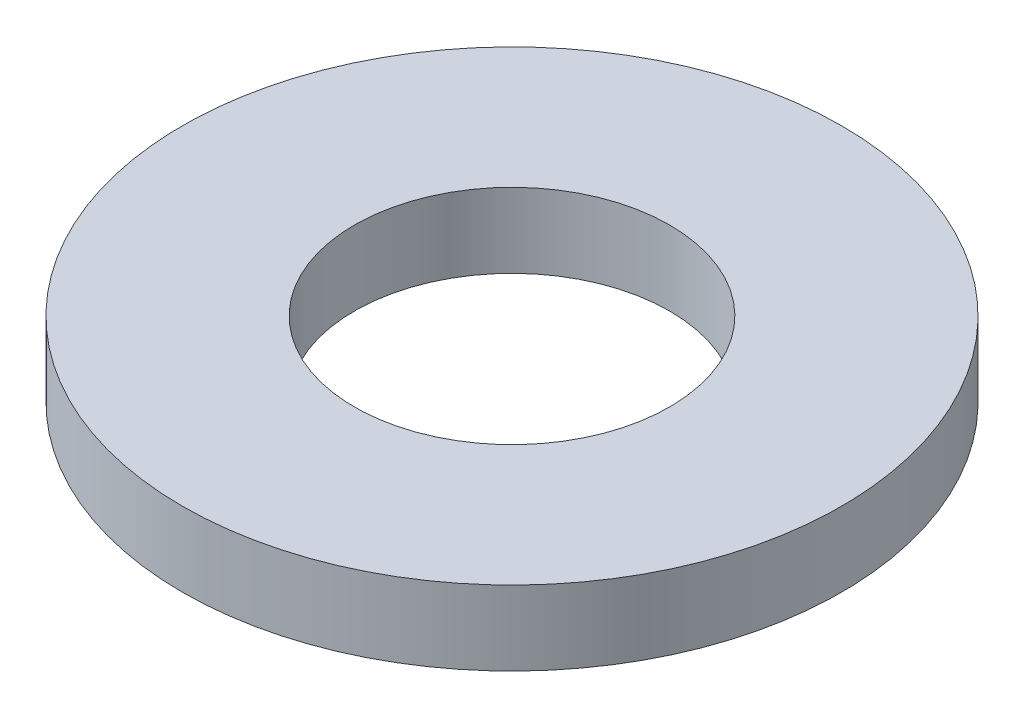
ISO-10303-21;
HEADER;
FILE_DESCRIPTION(('STEP AP214'),'2;1');
FILE_NAME('part.step','',(''),(''),'','','');
FILE_SCHEMA(('AUTOMOTIVE_DESIGN { 1 0 10303 214 1 1 1 1 }'));
ENDSEC;
DATA;
#1=APPLICATION_CONTEXT('core data for automotive mechanical design processes');
#2=APPLICATION_PROTOCOL_DEFINITION('international standard','automotive_design',2000,#1);
#3=PRODUCT_CONTEXT('',#1,'mechanical');
#4=PRODUCT('Part','Part','',(#3));
#5=PRODUCT_RELATED_PRODUCT_CATEGORY('part','',(#4));
#6=PRODUCT_DEFINITION_FORMATION('','',#4);
#7=PRODUCT_DEFINITION_CONTEXT('part definition',#1,'design');
#8=PRODUCT_DEFINITION('design','',#6,#7);
#9=PRODUCT_DEFINITION_SHAPE('','',#8);
#10=(LENGTH_UNIT() NAMED_UNIT(*) SI_UNIT(.MILLI.,.METRE.));
#11=(NAMED_UNIT(*) PLANE_ANGLE_UNIT() SI_UNIT($,.RADIAN.));
#12=(NAMED_UNIT(*) SI_UNIT($,.STERADIAN.) SOLID_ANGLE_UNIT());
#13=UNCERTAINTY_MEASURE_WITH_UNIT(LENGTH_MEASURE(1.E-05),#10,'distance_accuracy_value','');
#14=(GEOMETRIC_REPRESENTATION_CONTEXT(3) GLOBAL_UNCERTAINTY_ASSIGNED_CONTEXT((#13)) GLOBAL_UNIT_ASSIGNED_CONTEXT((#10,
#11,#12)) REPRESENTATION_CONTEXT('',''));
#15=CARTESIAN_POINT('',(0.,0.,0.));
#16=DIRECTION('',(0.,0.,1.));
#17=DIRECTION('',(1.,0.,0.));
#18=AXIS2_PLACEMENT_3D('',#15,#16,#17);
#19=CARTESIAN_POINT('',(0.,13.,0.));
#20=DIRECTION('',(0.,-1.,0.));
#21=DIRECTION('',(0.,0.,-1.));
#22=AXIS2_PLACEMENT_3D('',#19,#20,#21);
#23=CYLINDRICAL_SURFACE('',#22,57.5);
#24=CARTESIAN_POINT('',(0.,13.,0.));
#25=DIRECTION('',(0.,1.,0.));
#26=DIRECTION('',(0.,0.,1.));
#27=AXIS2_PLACEMENT_3D('',#24,#25,#26);
#28=CIRCLE('',#27,57.5);
#29=CARTESIAN_POINT('',(0.,13.,-57.5));
#30=VERTEX_POINT('',#29);
#31=EDGE_CURVE('E10',#30,#30,#28,.T.);
#32=CARTESIAN_POINT('',(0.,0.,0.));
#33=DIRECTION('',(0.,1.,0.));
#34=DIRECTION('',(0.,0.,1.));
#35=AXIS2_PLACEMENT_3D('',#32,#33,#34);
#36=CIRCLE('',#35,57.5);
#37=CARTESIAN_POINT('',(0.,0.,-57.5));
#38=VERTEX_POINT('',#37);
#39=EDGE_CURVE('E37',#38,#38,#36,.T.);
#40=CARTESIAN_POINT('',(0.,13.,-57.5));
#41=CARTESIAN_POINT('',(0.,12.8645833333333,-57.5));
#42=CARTESIAN_POINT('',(0.,12.7291666666667,-57.5));
#43=CARTESIAN_POINT('',(0.,12.4583333333333,-57.5));
#44=CARTESIAN_POINT('',(0.,12.3229166666667,-57.5));
#45=CARTESIAN_POINT('',(0.,12.0520833333333,-57.5));
#46=CARTESIAN_POINT('',(0.,11.9166666666667,-57.5));
#47=CARTESIAN_POINT('',(0.,11.6458333333333,-57.5));
#48=CARTESIAN_POINT('',(0.,11.5104166666667,-57.5));
#49=CARTESIAN_POINT('',(0.,11.2395833333333,-57.5));
#50=CARTESIAN_POINT('',(0.,11.1041666666667,-57.5));
#51=CARTESIAN_POINT('',(0.,10.8333333333333,-57.5));
#52=CARTESIAN_POINT('',(0.,10.6979166666667,-57.5));
#53=CARTESIAN_POINT('',(0.,10.4270833333333,-57.5));
#54=CARTESIAN_POINT('',(0.,10.2916666666667,-57.5));
#55=CARTESIAN_POINT('',(0.,10.0208333333333,-57.5));
#56=CARTESIAN_POINT('',(0.,9.88541666666667,-57.5));
#57=CARTESIAN_POINT('',(0.,9.61458333333333,-57.5));
#58=CARTESIAN_POINT('',(0.,9.47916666666667,-57.5));
#59=CARTESIAN_POINT('',(0.,9.20833333333333,-57.5));
#60=CARTESIAN_POINT('',(0.,9.07291666666667,-57.5));
#61=CARTESIAN_POINT('',(0.,8.80208333333333,-57.5));
#62=CARTESIAN_POINT('',(0.,8.66666666666667,-57.5));
#63=CARTESIAN_POINT('',(0.,8.39583333333333,-57.5));
#64=CARTESIAN_POINT('',(0.,8.26041666666667,-57.5));
#65=CARTESIAN_POINT('',(0.,7.98958333333333,-57.5));
#66=CARTESIAN_POINT('',(0.,7.85416666666667,-57.5));
#67=CARTESIAN_POINT('',(0.,7.58333333333333,-57.5));
#68=CARTESIAN_POINT('',(0.,7.44791666666667,-57.5));
#69=CARTESIAN_POINT('',(0.,7.17708333333333,-57.5));
#70=CARTESIAN_POINT('',(0.,7.04166666666667,-57.5));
#71=CARTESIAN_POINT('',(0.,6.77083333333333,-57.5));
#72=CARTESIAN_POINT('',(0.,6.63541666666667,-57.5));
#73=CARTESIAN_POINT('',(0.,6.36458333333333,-57.5));
#74=CARTESIAN_POINT('',(0.,6.22916666666667,-57.5));
#75=CARTESIAN_POINT('',(0.,5.95833333333333,-57.5));
#76=CARTESIAN_POINT('',(0.,5.82291666666667,-57.5));
#77=CARTESIAN_POINT('',(0.,5.55208333333333,-57.5));
#78=CARTESIAN_POINT('',(0.,5.41666666666667,-57.5));
#79=CARTESIAN_POINT('',(0.,5.14583333333333,-57.5));
#80=CARTESIAN_POINT('',(0.,5.01041666666667,-57.5));
#81=CARTESIAN_POINT('',(0.,4.73958333333333,-57.5));
#82=CARTESIAN_POINT('',(0.,4.60416666666667,-57.5));
#83=CARTESIAN_POINT('',(0.,4.33333333333333,-57.5));
#84=CARTESIAN_POINT('',(0.,4.19791666666667,-57.5));
#85=CARTESIAN_POINT('',(0.,3.92708333333333,-57.5));
#86=CARTESIAN_POINT('',(0.,3.79166666666667,-57.5));
#87=CARTESIAN_POINT('',(0.,3.52083333333333,-57.5));
#88=CARTESIAN_POINT('',(0.,3.38541666666667,-57.5));
#89=CARTESIAN_POINT('',(0.,3.11458333333333,-57.5));
#90=CARTESIAN_POINT('',(0.,2.97916666666667,-57.5));
#91=CARTESIAN_POINT('',(0.,2.70833333333333,-57.5));
#92=CARTESIAN_POINT('',(0.,2.57291666666667,-57.5));
#93=CARTESIAN_POINT('',(0.,2.30208333333333,-57.5));
#94=CARTESIAN_POINT('',(0.,2.16666666666667,-57.5));
#95=CARTESIAN_POINT('',(0.,1.89583333333333,-57.5));
#96=CARTESIAN_POINT('',(0.,1.76041666666667,-57.5));
#97=CARTESIAN_POINT('',(0.,1.48958333333333,-57.5));
#98=CARTESIAN_POINT('',(0.,1.35416666666667,-57.5));
#99=CARTESIAN_POINT('',(0.,1.08333333333333,-57.5));
#100=CARTESIAN_POINT('',(0.,0.947916666666667,-57.5));
#101=CARTESIAN_POINT('',(0.,0.677083333333334,-57.5));
#102=CARTESIAN_POINT('',(0.,0.541666666666667,-57.5));
#103=CARTESIAN_POINT('',(0.,0.270833333333334,-57.5));
#104=CARTESIAN_POINT('',(0.,0.135416666666667,-57.5));
#105=CARTESIAN_POINT('',(0.,0.,-57.5));
#106=B_SPLINE_CURVE_WITH_KNOTS('',3,(#40,#41,#42,#43,#44,#45,#46,#47,#48,#49,#50,#51,#52,#53,
#54,#55,#56,#57,#58,#59,#60,#61,#62,#63,#64,#65,#66,#67,#68,#69,#70,#71,#72,#73,#74,#75,#76,#77,
#78,#79,#80,#81,#82,#83,#84,#85,#86,#87,#88,#89,#90,#91,#92,#93,#94,#95,#96,#97,#98,#99,#100,
#101,#102,#103,#104,#105),.UNSPECIFIED.,.F.,.F.,(4,2,2,2,2,2,2,2,2,2,2,2,2,2,2,2,2,2,2,2,2,2,2,
2,2,2,2,2,2,2,2,2,4),(0.,0.406249999999999,0.812499999999999,1.21875,1.625,2.03125,2.4375,
2.84375,3.25,3.65625,4.0625,4.46875,4.875,5.28125,5.6875,6.09375,6.5,6.90625,7.3125,7.71875,
8.125,8.53125,8.9375,9.34375,9.75,10.15625,10.5625,10.96875,11.375,11.78125,12.1875,12.59375,
13.),.UNSPECIFIED.);
#107=EDGE_CURVE('BSEAM40',#30,#38,#106,.T.);
#108=ORIENTED_EDGE('',*,*,#31,.F.);
#109=ORIENTED_EDGE('',*,*,#39,.T.);
#110=ORIENTED_EDGE('',*,*,#107,.T.);
#111=ORIENTED_EDGE('',*,*,#107,.F.);
#112=EDGE_LOOP('',(#108,#110,#109,#111));
#113=FACE_BOUND('',#112,.T.);
#114=ADVANCED_FACE('F40',(#113),#23,.T.);
#115=CARTESIAN_POINT('',(0.,13.,0.));
#116=DIRECTION('',(0.,1.,0.));
#117=DIRECTION('',(0.,0.,1.));
#118=AXIS2_PLACEMENT_3D('',#115,#116,#117);
#119=PLANE('',#118);
#120=CARTESIAN_POINT('',(0.,13.,0.));
#121=DIRECTION('',(0.,1.,0.));
#122=DIRECTION('',(0.,0.,1.));
#123=AXIS2_PLACEMENT_3D('',#120,#121,#122);
#124=CIRCLE('',#123,27.5);
#125=CARTESIAN_POINT('',(0.,13.,-27.5));
#126=VERTEX_POINT('',#125);
#127=EDGE_CURVE('E50',#126,#126,#124,.T.);
#128=ORIENTED_EDGE('',*,*,#127,.F.);
#129=EDGE_LOOP('',(#128));
#130=FACE_BOUND('',#129,.T.);
#131=ORIENTED_EDGE('',*,*,#31,.T.);
#132=EDGE_LOOP('',(#131));
#133=FACE_BOUND('',#132,.T.);
#134=ADVANCED_FACE('F59',(#130,#133),#119,.T.);
#135=CARTESIAN_POINT('',(0.,0.,0.));
#136=DIRECTION('',(0.,1.,0.));
#137=DIRECTION('',(0.,0.,1.));
#138=AXIS2_PLACEMENT_3D('',#135,#136,#137);
#139=PLANE('',#138);
#140=CARTESIAN_POINT('',(0.,0.,0.));
#141=DIRECTION('',(0.,1.,0.));
#142=DIRECTION('',(0.,0.,1.));
#143=AXIS2_PLACEMENT_3D('',#140,#141,#142);
#144=CIRCLE('',#143,27.5);
#145=CARTESIAN_POINT('',(0.,0.,-27.5));
#146=VERTEX_POINT('',#145);
#147=EDGE_CURVE('E47',#146,#146,#144,.T.);
#148=ORIENTED_EDGE('',*,*,#147,.T.);
#149=EDGE_LOOP('',(#148));
#150=FACE_BOUND('',#149,.T.);
#151=ORIENTED_EDGE('',*,*,#39,.F.);
#152=EDGE_LOOP('',(#151));
#153=FACE_BOUND('',#152,.T.);
#154=ADVANCED_FACE('F58',(#150,#153),#139,.F.);
#155=CARTESIAN_POINT('',(0.,13.,0.));
#156=DIRECTION('',(0.,-1.,0.));
#157=DIRECTION('',(0.,0.,-1.));
#158=AXIS2_PLACEMENT_3D('',#155,#156,#157);
#159=CYLINDRICAL_SURFACE('',#158,27.5);
#160=CARTESIAN_POINT('',(0.,13.,-27.5));
#161=CARTESIAN_POINT('',(0.,12.8645833333333,-27.5));
#162=CARTESIAN_POINT('',(0.,12.7291666666667,-27.5));
#163=CARTESIAN_POINT('',(0.,12.4583333333333,-27.5));
#164=CARTESIAN_POINT('',(0.,12.3229166666667,-27.5));
#165=CARTESIAN_POINT('',(0.,12.0520833333333,-27.5));
#166=CARTESIAN_POINT('',(0.,11.9166666666667,-27.5));
#167=CARTESIAN_POINT('',(0.,11.6458333333333,-27.5));
#168=CARTESIAN_POINT('',(0.,11.5104166666667,-27.5));
#169=CARTESIAN_POINT('',(0.,11.2395833333333,-27.5));
#170=CARTESIAN_POINT('',(0.,11.1041666666667,-27.5));
#171=CARTESIAN_POINT('',(0.,10.8333333333333,-27.5));
#172=CARTESIAN_POINT('',(0.,10.6979166666667,-27.5));
#173=CARTESIAN_POINT('',(0.,10.4270833333333,-27.5));
#174=CARTESIAN_POINT('',(0.,10.2916666666667,-27.5));
#175=CARTESIAN_POINT('',(0.,10.0208333333333,-27.5));
#176=CARTESIAN_POINT('',(0.,9.88541666666667,-27.5));
#177=CARTESIAN_POINT('',(0.,9.61458333333333,-27.5));
#178=CARTESIAN_POINT('',(0.,9.47916666666667,-27.5));
#179=CARTESIAN_POINT('',(0.,9.20833333333333,-27.5));
#180=CARTESIAN_POINT('',(0.,9.07291666666666,-27.5));
#181=CARTESIAN_POINT('',(0.,8.80208333333333,-27.5));
#182=CARTESIAN_POINT('',(0.,8.66666666666667,-27.5));
#183=CARTESIAN_POINT('',(0.,8.39583333333333,-27.5));
#184=CARTESIAN_POINT('',(0.,8.26041666666667,-27.5));
#185=CARTESIAN_POINT('',(0.,7.98958333333333,-27.5));
#186=CARTESIAN_POINT('',(0.,7.85416666666667,-27.5));
#187=CARTESIAN_POINT('',(0.,7.58333333333333,-27.5));
#188=CARTESIAN_POINT('',(0.,7.44791666666667,-27.5));
#189=CARTESIAN_POINT('',(0.,7.17708333333333,-27.5));
#190=CARTESIAN_POINT('',(0.,7.04166666666667,-27.5));
#191=CARTESIAN_POINT('',(0.,6.77083333333333,-27.5));
#192=CARTESIAN_POINT('',(0.,6.63541666666667,-27.5));
#193=CARTESIAN_POINT('',(0.,6.36458333333333,-27.5));
#194=CARTESIAN_POINT('',(0.,6.22916666666667,-27.5));
#195=CARTESIAN_POINT('',(0.,5.95833333333333,-27.5));
#196=CARTESIAN_POINT('',(0.,5.82291666666667,-27.5));
#197=CARTESIAN_POINT('',(0.,5.55208333333333,-27.5));
#198=CARTESIAN_POINT('',(0.,5.41666666666667,-27.5));
#199=CARTESIAN_POINT('',(0.,5.14583333333333,-27.5));
#200=CARTESIAN_POINT('',(0.,5.01041666666667,-27.5));
#201=CARTESIAN_POINT('',(0.,4.73958333333333,-27.5));
#202=CARTESIAN_POINT('',(0.,4.60416666666667,-27.5));
#203=CARTESIAN_POINT('',(0.,4.33333333333333,-27.5));
#204=CARTESIAN_POINT('',(0.,4.19791666666667,-27.5));
#205=CARTESIAN_POINT('',(0.,3.92708333333333,-27.5));
#206=CARTESIAN_POINT('',(0.,3.79166666666667,-27.5));
#207=CARTESIAN_POINT('',(0.,3.52083333333333,-27.5));
#208=CARTESIAN_POINT('',(0.,3.38541666666667,-27.5));
#209=CARTESIAN_POINT('',(0.,3.11458333333333,-27.5));
#210=CARTESIAN_POINT('',(0.,2.97916666666667,-27.5));
#211=CARTESIAN_POINT('',(0.,2.70833333333333,-27.5));
#212=CARTESIAN_POINT('',(0.,2.57291666666667,-27.5));
#213=CARTESIAN_POINT('',(0.,2.30208333333333,-27.5));
#214=CARTESIAN_POINT('',(0.,2.16666666666667,-27.5));
#215=CARTESIAN_POINT('',(0.,1.89583333333333,-27.5));
#216=CARTESIAN_POINT('',(0.,1.76041666666667,-27.5));
#217=CARTESIAN_POINT('',(0.,1.48958333333333,-27.5));
#218=CARTESIAN_POINT('',(0.,1.35416666666667,-27.5));
#219=CARTESIAN_POINT('',(0.,1.08333333333333,-27.5));
#220=CARTESIAN_POINT('',(0.,0.947916666666667,-27.5));
#221=CARTESIAN_POINT('',(0.,0.677083333333334,-27.5));
#222=CARTESIAN_POINT('',(0.,0.541666666666667,-27.5));
#223=CARTESIAN_POINT('',(0.,0.270833333333334,-27.5));
#224=CARTESIAN_POINT('',(0.,0.135416666666667,-27.5));
#225=CARTESIAN_POINT('',(0.,0.,-27.5));
#226=B_SPLINE_CURVE_WITH_KNOTS('',3,(#160,#161,#162,#163,#164,#165,#166,#167,#168,#169,#170,
#171,#172,#173,#174,#175,#176,#177,#178,#179,#180,#181,#182,#183,#184,#185,#186,#187,#188,#189,
#190,#191,#192,#193,#194,#195,#196,#197,#198,#199,#200,#201,#202,#203,#204,#205,#206,#207,#208,
#209,#210,#211,#212,#213,#214,#215,#216,#217,#218,#219,#220,#221,#222,#223,#224,#225),
.UNSPECIFIED.,.F.,.F.,(4,2,2,2,2,2,2,2,2,2,2,2,2,2,2,2,2,2,2,2,2,2,2,2,2,2,2,2,2,2,2,2,4),(0.,
0.40625,0.812500000000001,1.21875,1.625,2.03125,2.4375,2.84375,3.25,3.65625,4.0625,4.46875,
4.875,5.28125,5.6875,6.09375,6.5,6.90625,7.3125,7.71875,8.125,8.53125,8.9375,9.34375,9.75,
10.15625,10.5625,10.96875,11.375,11.78125,12.1875,12.59375,13.),.UNSPECIFIED.);
#227=EDGE_CURVE('BSEAM54',#126,#146,#226,.T.);
#228=ORIENTED_EDGE('',*,*,#127,.T.);
#229=ORIENTED_EDGE('',*,*,#147,.F.);
#230=ORIENTED_EDGE('',*,*,#227,.T.);
#231=ORIENTED_EDGE('',*,*,#227,.F.);
#232=EDGE_LOOP('',(#228,#230,#229,#231));
#233=FACE_BOUND('',#232,.T.);
#234=ADVANCED_FACE('F54',(#233),#159,.F.);
#235=CLOSED_SHELL('',(#114,#134,#154,#234));
#236=MANIFOLD_SOLID_BREP('B2',#235);
#237=ADVANCED_BREP_SHAPE_REPRESENTATION('',(#18,#236),#14);
#238=SHAPE_DEFINITION_REPRESENTATION(#9,#237);
ENDSEC;
END-ISO-10303-21;
